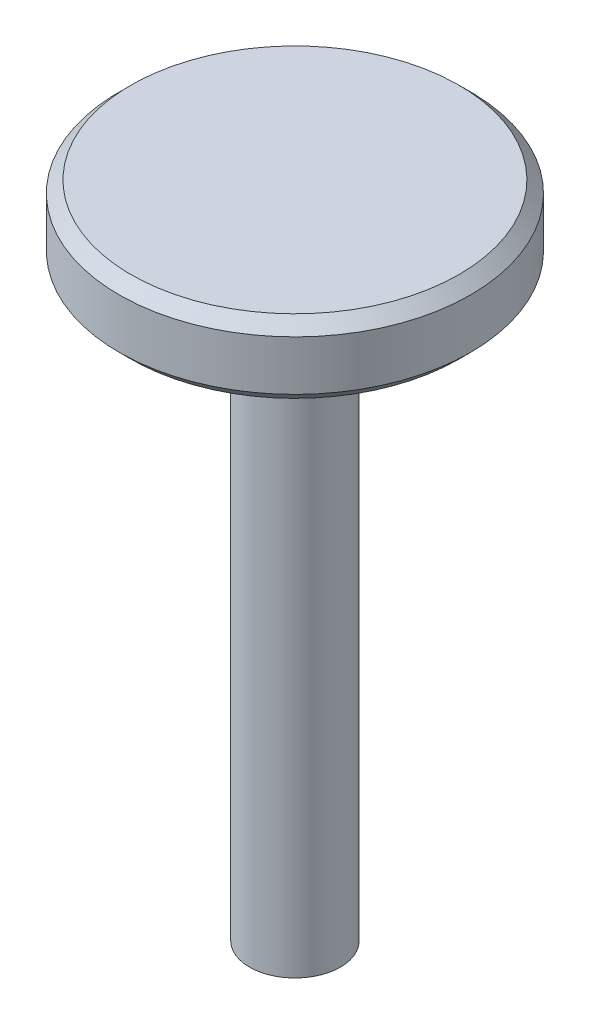
ISO-10303-21;
HEADER;
FILE_DESCRIPTION(('STEP AP214'),'2;1');
FILE_NAME('part.step','',(''),(''),'','','');
FILE_SCHEMA(('AUTOMOTIVE_DESIGN { 1 0 10303 214 1 1 1 1 }'));
ENDSEC;
DATA;
#1=APPLICATION_CONTEXT('core data for automotive mechanical design processes');
#2=APPLICATION_PROTOCOL_DEFINITION('international standard','automotive_design',2000,#1);
#3=PRODUCT_CONTEXT('',#1,'mechanical');
#4=PRODUCT('Part','Part','',(#3));
#5=PRODUCT_RELATED_PRODUCT_CATEGORY('part','',(#4));
#6=PRODUCT_DEFINITION_FORMATION('','',#4);
#7=PRODUCT_DEFINITION_CONTEXT('part definition',#1,'design');
#8=PRODUCT_DEFINITION('design','',#6,#7);
#9=PRODUCT_DEFINITION_SHAPE('','',#8);
#10=(LENGTH_UNIT() NAMED_UNIT(*) SI_UNIT(.MILLI.,.METRE.));
#11=(NAMED_UNIT(*) PLANE_ANGLE_UNIT() SI_UNIT($,.RADIAN.));
#12=(NAMED_UNIT(*) SI_UNIT($,.STERADIAN.) SOLID_ANGLE_UNIT());
#13=UNCERTAINTY_MEASURE_WITH_UNIT(LENGTH_MEASURE(1.E-05),#10,'distance_accuracy_value','');
#14=(GEOMETRIC_REPRESENTATION_CONTEXT(3) GLOBAL_UNCERTAINTY_ASSIGNED_CONTEXT((#13)) GLOBAL_UNIT_ASSIGNED_CONTEXT((#10,
#11,#12)) REPRESENTATION_CONTEXT('',''));
#15=CARTESIAN_POINT('',(0.,0.,0.));
#16=DIRECTION('',(0.,0.,1.));
#17=DIRECTION('',(1.,0.,0.));
#18=AXIS2_PLACEMENT_3D('',#15,#16,#17);
#19=CARTESIAN_POINT('',(-8.49999277070864,6.20044378023227,-106.246990075042));
#20=DIRECTION('',(0.,-1.,1.0071112731931E-13));
#21=DIRECTION('',(-1.,0.,0.));
#22=AXIS2_PLACEMENT_3D('',#19,#20,#21);
#23=PLANE('',#22);
#24=CARTESIAN_POINT('',(-8.49999277070864,6.20044378023227,-106.246990075042));
#25=DIRECTION('',(0.,1.,-1.0071112731931E-13));
#26=DIRECTION('',(-1.,0.,0.));
#27=AXIS2_PLACEMENT_3D('',#24,#25,#26);
#28=CIRCLE('',#27,1.55024047358084);
#29=CARTESIAN_POINT('',(-6.9497522971278,6.20044378023227,-106.246990075042));
#30=VERTEX_POINT('',#29);
#31=EDGE_CURVE('E24',#30,#30,#28,.T.);
#32=ORIENTED_EDGE('',*,*,#31,.F.);
#33=EDGE_LOOP('',(#32));
#34=FACE_BOUND('',#33,.T.);
#35=ADVANCED_FACE('F16',(#34),#23,.T.);
#36=CARTESIAN_POINT('',(-8.49999277070872,26.2004437802323,-106.246990075044));
#37=DIRECTION('',(0.,1.,-1.00364161426114E-13));
#38=DIRECTION('',(-1.,0.,0.));
#39=AXIS2_PLACEMENT_3D('',#36,#37,#38);
#40=CYLINDRICAL_SURFACE('',#39,1.55024047358084);
#41=ORIENTED_EDGE('',*,*,#31,.T.);
#42=DIRECTION('',(0.,1.,-1.00364161426114E-13));
#43=VECTOR('',#42,1.);
#44=CARTESIAN_POINT('',(-6.94975229712789,26.2004437802323,-106.246990075044));
#45=LINE('',#44,#43);
#46=CARTESIAN_POINT('',(-6.94975229712789,26.2004437802323,-106.246990075044));
#47=VERTEX_POINT('',#46);
#48=EDGE_CURVE('E11',#30,#47,#45,.T.);
#49=ORIENTED_EDGE('',*,*,#48,.T.);
#50=CARTESIAN_POINT('',(-8.49999277070872,26.2004437802323,-106.246990075044));
#51=DIRECTION('',(0.,-1.,1.0071112731931E-13));
#52=DIRECTION('',(-1.,0.,0.));
#53=AXIS2_PLACEMENT_3D('',#50,#51,#52);
#54=CIRCLE('',#53,1.55024047358084);
#55=EDGE_CURVE('E68',#47,#47,#54,.T.);
#56=ORIENTED_EDGE('',*,*,#55,.T.);
#57=ORIENTED_EDGE('',*,*,#48,.F.);
#58=EDGE_LOOP('',(#41,#49,#56,#57));
#59=FACE_BOUND('',#58,.T.);
#60=ADVANCED_FACE('F92',(#59),#40,.T.);
#61=CARTESIAN_POINT('',(-8.49999277070872,26.4004437802323,-106.246990075044));
#62=DIRECTION('',(0.,1.,0.));
#63=DIRECTION('',(-1.,0.,0.));
#64=AXIS2_PLACEMENT_3D('',#61,#62,#63);
#65=CONICAL_SURFACE('',#64,5.8,0.78539816339746);
#66=CARTESIAN_POINT('',(-8.49999277070873,26.6004437802323,-106.246990075044));
#67=DIRECTION('',(0.,1.,-1.0071112731931E-13));
#68=DIRECTION('',(-1.,0.,0.));
#69=AXIS2_PLACEMENT_3D('',#66,#67,#68);
#70=CIRCLE('',#69,6.);
#71=CARTESIAN_POINT('',(-2.49999277070872,26.6004437802323,-106.246990075044));
#72=VERTEX_POINT('',#71);
#73=EDGE_CURVE('E61',#72,#72,#70,.T.);
#74=ORIENTED_EDGE('',*,*,#73,.F.);
#75=DIRECTION('',(-0.707106781186552,-0.707106781186543,0.));
#76=VECTOR('',#75,1.);
#77=CARTESIAN_POINT('',(-2.69999277070872,26.4004437802323,-106.246990075044));
#78=LINE('',#77,#76);
#79=CARTESIAN_POINT('',(-2.89999277070871,26.2004437802323,-106.246990075044));
#80=VERTEX_POINT('',#79);
#81=EDGE_CURVE('E43',#72,#80,#78,.T.);
#82=ORIENTED_EDGE('',*,*,#81,.T.);
#83=CARTESIAN_POINT('',(-8.49999277070872,26.2004437802323,-106.246990075044));
#84=DIRECTION('',(0.,-1.,1.0071112731931E-13));
#85=DIRECTION('',(-1.,0.,0.));
#86=AXIS2_PLACEMENT_3D('',#83,#84,#85);
#87=CIRCLE('',#86,5.6);
#88=EDGE_CURVE('E60',#80,#80,#87,.T.);
#89=ORIENTED_EDGE('',*,*,#88,.F.);
#90=ORIENTED_EDGE('',*,*,#81,.F.);
#91=EDGE_LOOP('',(#74,#82,#89,#90));
#92=FACE_BOUND('',#91,.T.);
#93=ADVANCED_FACE('F59',(#92),#65,.T.);
#94=CARTESIAN_POINT('',(-8.49999277070873,28.7004437802323,-106.246990075045));
#95=DIRECTION('',(0.,-1.,1.0071112731931E-13));
#96=DIRECTION('',(-1.,0.,0.));
#97=AXIS2_PLACEMENT_3D('',#94,#95,#96);
#98=PLANE('',#97);
#99=CARTESIAN_POINT('',(-8.49999277070873,28.7004437802323,-106.246990075045));
#100=DIRECTION('',(0.,1.,-1.0071112731931E-13));
#101=DIRECTION('',(-1.,0.,0.));
#102=AXIS2_PLACEMENT_3D('',#99,#100,#101);
#103=CIRCLE('',#102,5.6);
#104=CARTESIAN_POINT('',(-2.89999277070873,28.7004437802323,-106.246990075045));
#105=VERTEX_POINT('',#104);
#106=EDGE_CURVE('E73',#105,#105,#103,.T.);
#107=ORIENTED_EDGE('',*,*,#106,.T.);
#108=EDGE_LOOP('',(#107));
#109=FACE_BOUND('',#108,.T.);
#110=ADVANCED_FACE('F102',(#109),#98,.F.);
#111=CARTESIAN_POINT('',(-8.49999277070872,26.2004437802323,-106.246990075044));
#112=DIRECTION('',(0.,-1.,0.));
#113=DIRECTION('',(-1.,0.,0.));
#114=AXIS2_PLACEMENT_3D('',#111,#112,#113);
#115=CYLINDRICAL_SURFACE('',#114,6.);
#116=CARTESIAN_POINT('',(-8.49999277070873,28.3004437802322,-106.246990075045));
#117=DIRECTION('',(0.,-1.,1.0071112731931E-13));
#118=DIRECTION('',(-1.,0.,0.));
#119=AXIS2_PLACEMENT_3D('',#116,#117,#118);
#120=CIRCLE('',#119,6.);
#121=CARTESIAN_POINT('',(-2.49999277070872,28.3004437802323,-106.246990075045));
#122=VERTEX_POINT('',#121);
#123=EDGE_CURVE('E81',#122,#122,#120,.T.);
#124=ORIENTED_EDGE('',*,*,#123,.T.);
#125=DIRECTION('',(0.,-1.,0.));
#126=VECTOR('',#125,1.);
#127=CARTESIAN_POINT('',(-2.49999277070871,26.2004437802323,-106.246990075044));
#128=LINE('',#127,#126);
#129=EDGE_CURVE('E84',#122,#72,#128,.T.);
#130=ORIENTED_EDGE('',*,*,#129,.T.);
#131=ORIENTED_EDGE('',*,*,#73,.T.);
#132=ORIENTED_EDGE('',*,*,#129,.F.);
#133=EDGE_LOOP('',(#124,#130,#131,#132));
#134=FACE_BOUND('',#133,.T.);
#135=ADVANCED_FACE('F106',(#134),#115,.T.);
#136=CARTESIAN_POINT('',(-8.49999277070873,28.5004437802323,-106.246990075045));
#137=DIRECTION('',(0.,-1.,0.));
#138=DIRECTION('',(-1.,0.,0.));
#139=AXIS2_PLACEMENT_3D('',#136,#137,#138);
#140=CONICAL_SURFACE('',#139,5.8,0.785398163397436);
#141=ORIENTED_EDGE('',*,*,#106,.F.);
#142=DIRECTION('',(0.707106781186543,-0.707106781186552,0.));
#143=VECTOR('',#142,1.);
#144=CARTESIAN_POINT('',(-2.69999277070872,28.5004437802323,-106.246990075045));
#145=LINE('',#144,#143);
#146=EDGE_CURVE('E77',#105,#122,#145,.T.);
#147=ORIENTED_EDGE('',*,*,#146,.T.);
#148=ORIENTED_EDGE('',*,*,#123,.F.);
#149=ORIENTED_EDGE('',*,*,#146,.F.);
#150=EDGE_LOOP('',(#141,#147,#148,#149));
#151=FACE_BOUND('',#150,.T.);
#152=ADVANCED_FACE('F111',(#151),#140,.T.);
#153=CARTESIAN_POINT('',(-8.49999277070872,26.2004437802323,-106.246990075044));
#154=DIRECTION('',(0.,-1.,1.0071112731931E-13));
#155=DIRECTION('',(-1.,0.,0.));
#156=AXIS2_PLACEMENT_3D('',#153,#154,#155);
#157=PLANE('',#156);
#158=ORIENTED_EDGE('',*,*,#55,.F.);
#159=EDGE_LOOP('',(#158));
#160=FACE_BOUND('',#159,.T.);
#161=ORIENTED_EDGE('',*,*,#88,.T.);
#162=EDGE_LOOP('',(#161));
#163=FACE_BOUND('',#162,.T.);
#164=ADVANCED_FACE('F66',(#160,#163),#157,.T.);
#165=CLOSED_SHELL('',(#35,#60,#93,#110,#135,#152,#164));
#166=MANIFOLD_SOLID_BREP('B1',#165);
#167=ADVANCED_BREP_SHAPE_REPRESENTATION('',(#18,#166),#14);
#168=SHAPE_DEFINITION_REPRESENTATION(#9,#167);
ENDSEC;
END-ISO-10303-21;
